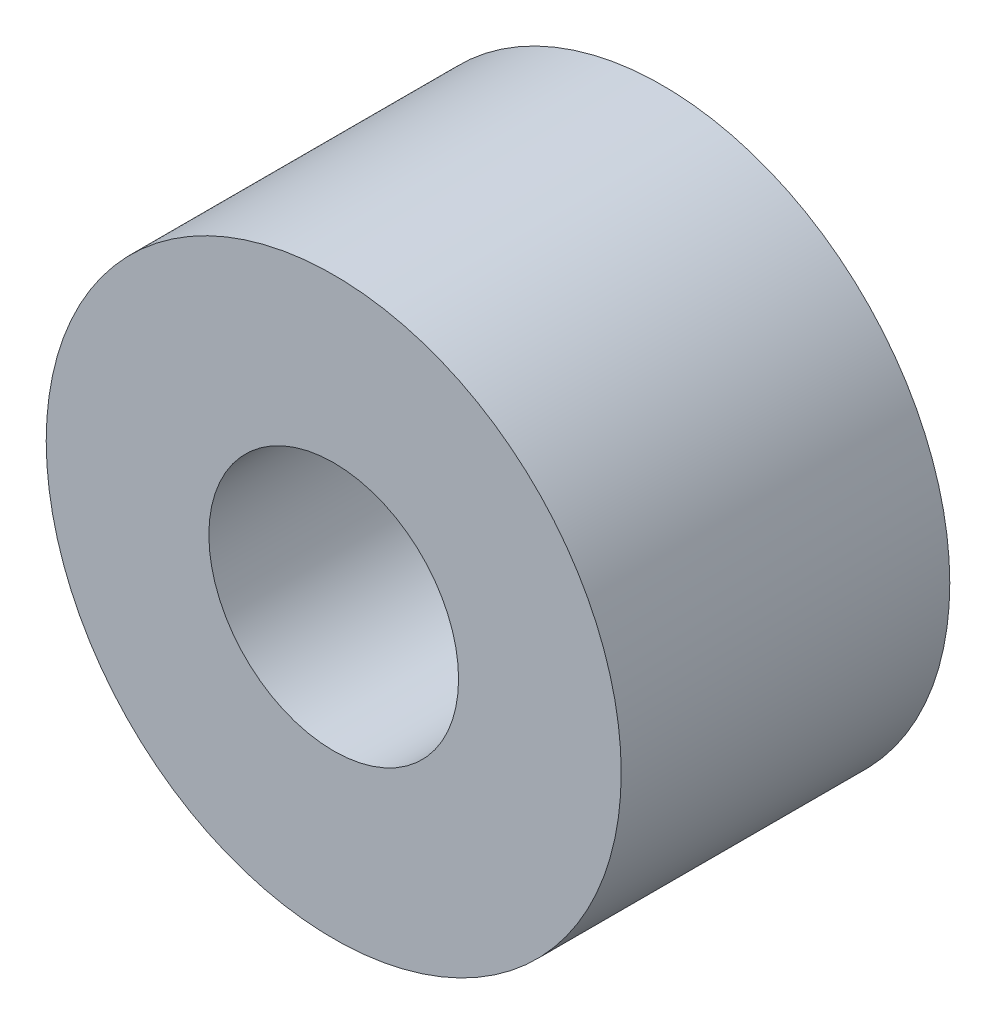
ISO-10303-21;
HEADER;
FILE_DESCRIPTION(('STEP AP214'),'2;1');
FILE_NAME('part.step','',(''),(''),'','','');
FILE_SCHEMA(('AUTOMOTIVE_DESIGN { 1 0 10303 214 1 1 1 1 }'));
ENDSEC;
DATA;
#1=APPLICATION_CONTEXT('core data for automotive mechanical design processes');
#2=APPLICATION_PROTOCOL_DEFINITION('international standard','automotive_design',2000,#1);
#3=PRODUCT_CONTEXT('',#1,'mechanical');
#4=PRODUCT('Part','Part','',(#3));
#5=PRODUCT_RELATED_PRODUCT_CATEGORY('part','',(#4));
#6=PRODUCT_DEFINITION_FORMATION('','',#4);
#7=PRODUCT_DEFINITION_CONTEXT('part definition',#1,'design');
#8=PRODUCT_DEFINITION('design','',#6,#7);
#9=PRODUCT_DEFINITION_SHAPE('','',#8);
#10=(LENGTH_UNIT() NAMED_UNIT(*) SI_UNIT(.MILLI.,.METRE.));
#11=(NAMED_UNIT(*) PLANE_ANGLE_UNIT() SI_UNIT($,.RADIAN.));
#12=(NAMED_UNIT(*) SI_UNIT($,.STERADIAN.) SOLID_ANGLE_UNIT());
#13=UNCERTAINTY_MEASURE_WITH_UNIT(LENGTH_MEASURE(1.E-05),#10,'distance_accuracy_value','');
#14=(GEOMETRIC_REPRESENTATION_CONTEXT(3) GLOBAL_UNCERTAINTY_ASSIGNED_CONTEXT((#13)) GLOBAL_UNIT_ASSIGNED_CONTEXT((#10,
#11,#12)) REPRESENTATION_CONTEXT('',''));
#15=CARTESIAN_POINT('',(0.,0.,0.));
#16=DIRECTION('',(0.,0.,1.));
#17=DIRECTION('',(1.,0.,0.));
#18=AXIS2_PLACEMENT_3D('',#15,#16,#17);
#19=CARTESIAN_POINT('',(0.,0.,3.175));
#20=DIRECTION('',(0.,0.,-1.));
#21=DIRECTION('',(-1.,0.,0.));
#22=AXIS2_PLACEMENT_3D('',#19,#20,#21);
#23=CYLINDRICAL_SURFACE('',#22,5.55625);
#24=CARTESIAN_POINT('',(0.,0.,3.175));
#25=DIRECTION('',(0.,0.,1.));
#26=DIRECTION('',(1.,0.,0.));
#27=AXIS2_PLACEMENT_3D('',#24,#25,#26);
#28=CIRCLE('',#27,5.55625);
#29=CARTESIAN_POINT('',(5.55625,0.,3.175));
#30=VERTEX_POINT('',#29);
#31=EDGE_CURVE('E10',#30,#30,#28,.T.);
#32=ORIENTED_EDGE('',*,*,#31,.F.);
#33=EDGE_LOOP('',(#32));
#34=FACE_BOUND('',#33,.T.);
#35=CARTESIAN_POINT('',(0.,0.,-3.175));
#36=DIRECTION('',(0.,0.,1.));
#37=DIRECTION('',(1.,0.,0.));
#38=AXIS2_PLACEMENT_3D('',#35,#36,#37);
#39=CIRCLE('',#38,5.55625);
#40=CARTESIAN_POINT('',(5.55625,0.,-3.175));
#41=VERTEX_POINT('',#40);
#42=EDGE_CURVE('E40',#41,#41,#39,.T.);
#43=ORIENTED_EDGE('',*,*,#42,.T.);
#44=EDGE_LOOP('',(#43));
#45=FACE_BOUND('',#44,.T.);
#46=ADVANCED_FACE('F34',(#34,#45),#23,.T.);
#47=CARTESIAN_POINT('',(0.,0.,3.175));
#48=DIRECTION('',(0.,0.,1.));
#49=DIRECTION('',(1.,0.,0.));
#50=AXIS2_PLACEMENT_3D('',#47,#48,#49);
#51=PLANE('',#50);
#52=CARTESIAN_POINT('',(0.,0.,3.175));
#53=DIRECTION('',(0.,0.,1.));
#54=DIRECTION('',(1.,0.,0.));
#55=AXIS2_PLACEMENT_3D('',#52,#53,#54);
#56=CIRCLE('',#55,2.413);
#57=CARTESIAN_POINT('',(2.413,0.,3.175));
#58=VERTEX_POINT('',#57);
#59=EDGE_CURVE('E48',#58,#58,#56,.T.);
#60=ORIENTED_EDGE('',*,*,#59,.F.);
#61=EDGE_LOOP('',(#60));
#62=FACE_BOUND('',#61,.T.);
#63=ORIENTED_EDGE('',*,*,#31,.T.);
#64=EDGE_LOOP('',(#63));
#65=FACE_BOUND('',#64,.T.);
#66=ADVANCED_FACE('F56',(#62,#65),#51,.T.);
#67=CARTESIAN_POINT('',(0.,0.,-3.175));
#68=DIRECTION('',(0.,0.,1.));
#69=DIRECTION('',(1.,0.,0.));
#70=AXIS2_PLACEMENT_3D('',#67,#68,#69);
#71=PLANE('',#70);
#72=CARTESIAN_POINT('',(0.,0.,-3.175));
#73=DIRECTION('',(0.,0.,1.));
#74=DIRECTION('',(1.,0.,0.));
#75=AXIS2_PLACEMENT_3D('',#72,#73,#74);
#76=CIRCLE('',#75,2.413);
#77=CARTESIAN_POINT('',(2.413,0.,-3.175));
#78=VERTEX_POINT('',#77);
#79=EDGE_CURVE('E44',#78,#78,#76,.T.);
#80=ORIENTED_EDGE('',*,*,#79,.T.);
#81=EDGE_LOOP('',(#80));
#82=FACE_BOUND('',#81,.T.);
#83=ORIENTED_EDGE('',*,*,#42,.F.);
#84=EDGE_LOOP('',(#83));
#85=FACE_BOUND('',#84,.T.);
#86=ADVANCED_FACE('F58',(#82,#85),#71,.F.);
#87=CARTESIAN_POINT('',(0.,0.,-3.175));
#88=DIRECTION('',(0.,0.,1.));
#89=DIRECTION('',(1.,0.,0.));
#90=AXIS2_PLACEMENT_3D('',#87,#88,#89);
#91=CYLINDRICAL_SURFACE('',#90,2.413);
#92=ORIENTED_EDGE('',*,*,#79,.F.);
#93=EDGE_LOOP('',(#92));
#94=FACE_BOUND('',#93,.T.);
#95=ORIENTED_EDGE('',*,*,#59,.T.);
#96=EDGE_LOOP('',(#95));
#97=FACE_BOUND('',#96,.T.);
#98=ADVANCED_FACE('F54',(#94,#97),#91,.F.);
#99=CLOSED_SHELL('',(#46,#66,#86,#98));
#100=MANIFOLD_SOLID_BREP('B2',#99);
#101=ADVANCED_BREP_SHAPE_REPRESENTATION('',(#18,#100),#14);
#102=SHAPE_DEFINITION_REPRESENTATION(#9,#101);
ENDSEC;
END-ISO-10303-21;
